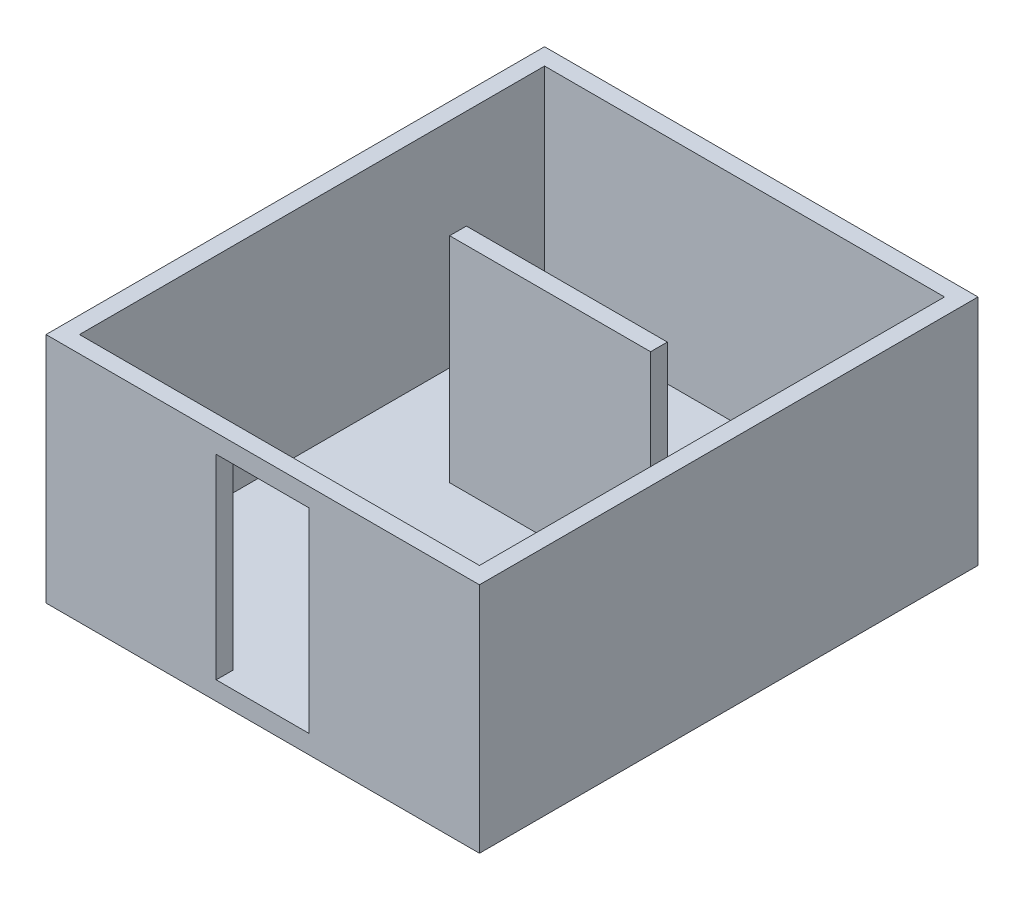
ISO-10303-21;
HEADER;
FILE_DESCRIPTION(('STEP AP214'),'2;1');
FILE_NAME('part.step','',(''),(''),'','','');
FILE_SCHEMA(('AUTOMOTIVE_DESIGN { 1 0 10303 214 1 1 1 1 }'));
ENDSEC;
DATA;
#1=APPLICATION_CONTEXT('core data for automotive mechanical design processes');
#2=APPLICATION_PROTOCOL_DEFINITION('international standard','automotive_design',2000,#1);
#3=PRODUCT_CONTEXT('',#1,'mechanical');
#4=PRODUCT('Part','Part','',(#3));
#5=PRODUCT_RELATED_PRODUCT_CATEGORY('part','',(#4));
#6=PRODUCT_DEFINITION_FORMATION('','',#4);
#7=PRODUCT_DEFINITION_CONTEXT('part definition',#1,'design');
#8=PRODUCT_DEFINITION('design','',#6,#7);
#9=PRODUCT_DEFINITION_SHAPE('','',#8);
#10=(LENGTH_UNIT() NAMED_UNIT(*) SI_UNIT(.MILLI.,.METRE.));
#11=(NAMED_UNIT(*) PLANE_ANGLE_UNIT() SI_UNIT($,.RADIAN.));
#12=(NAMED_UNIT(*) SI_UNIT($,.STERADIAN.) SOLID_ANGLE_UNIT());
#13=UNCERTAINTY_MEASURE_WITH_UNIT(LENGTH_MEASURE(1.E-05),#10,'distance_accuracy_value','');
#14=(GEOMETRIC_REPRESENTATION_CONTEXT(3) GLOBAL_UNCERTAINTY_ASSIGNED_CONTEXT((#13)) GLOBAL_UNIT_ASSIGNED_CONTEXT((#10,
#11,#12)) REPRESENTATION_CONTEXT('',''));
#15=CARTESIAN_POINT('',(0.,0.,0.));
#16=DIRECTION('',(0.,0.,1.));
#17=DIRECTION('',(1.,0.,0.));
#18=AXIS2_PLACEMENT_3D('',#15,#16,#17);
#19=CARTESIAN_POINT('',(0.,200.,0.));
#20=DIRECTION('',(1.,0.,0.));
#21=DIRECTION('',(0.,0.,-1.));
#22=AXIS2_PLACEMENT_3D('',#19,#20,#21);
#23=PLANE('',#22);
#24=DIRECTION('',(0.,0.,1.));
#25=VECTOR('',#24,1.);
#26=CARTESIAN_POINT('',(0.,0.,0.));
#27=LINE('',#26,#25);
#28=CARTESIAN_POINT('',(0.,0.,0.));
#29=VERTEX_POINT('',#28);
#30=CARTESIAN_POINT('',(6.56410684342981E-13,0.,5360.));
#31=VERTEX_POINT('',#30);
#32=EDGE_CURVE('E282',#29,#31,#27,.T.);
#33=ORIENTED_EDGE('',*,*,#32,.T.);
#34=DIRECTION('',(0.,-1.,0.));
#35=VECTOR('',#34,1.);
#36=CARTESIAN_POINT('',(6.56410684342981E-13,200.,5360.));
#37=LINE('',#36,#35);
#38=CARTESIAN_POINT('',(6.56410683868892E-13,2500.,5360.));
#39=VERTEX_POINT('',#38);
#40=EDGE_CURVE('E12',#39,#31,#37,.T.);
#41=ORIENTED_EDGE('',*,*,#40,.F.);
#42=DIRECTION('',(0.,0.,1.));
#43=VECTOR('',#42,1.);
#44=CARTESIAN_POINT('',(0.,2500.,0.));
#45=LINE('',#44,#43);
#46=CARTESIAN_POINT('',(0.,2500.,0.));
#47=VERTEX_POINT('',#46);
#48=EDGE_CURVE('E240',#47,#39,#45,.T.);
#49=ORIENTED_EDGE('',*,*,#48,.F.);
#50=DIRECTION('',(0.,-1.,0.));
#51=VECTOR('',#50,1.);
#52=CARTESIAN_POINT('',(0.,200.,0.));
#53=LINE('',#52,#51);
#54=EDGE_CURVE('E291',#47,#29,#53,.T.);
#55=ORIENTED_EDGE('',*,*,#54,.T.);
#56=EDGE_LOOP('',(#33,#41,#49,#55));
#57=FACE_BOUND('',#56,.T.);
#58=ADVANCED_FACE('F61',(#57),#23,.F.);
#59=CARTESIAN_POINT('',(6.56410684342981E-13,200.,5360.));
#60=DIRECTION('',(0.,0.,-1.));
#61=DIRECTION('',(-1.,0.,0.));
#62=AXIS2_PLACEMENT_3D('',#59,#60,#61);
#63=PLANE('',#62);
#64=DIRECTION('',(0.,-1.,0.));
#65=VECTOR('',#64,1.);
#66=CARTESIAN_POINT('',(1830.,2300.,5360.));
#67=LINE('',#66,#65);
#68=CARTESIAN_POINT('',(1830.,2300.,5360.));
#69=VERTEX_POINT('',#68);
#70=CARTESIAN_POINT('',(1830.,200.,5360.));
#71=VERTEX_POINT('',#70);
#72=EDGE_CURVE('E195',#69,#71,#67,.T.);
#73=ORIENTED_EDGE('',*,*,#72,.F.);
#74=DIRECTION('',(-1.,0.,0.));
#75=VECTOR('',#74,1.);
#76=CARTESIAN_POINT('',(1830.,2300.,5360.));
#77=LINE('',#76,#75);
#78=CARTESIAN_POINT('',(2830.,2300.,5360.));
#79=VERTEX_POINT('',#78);
#80=EDGE_CURVE('E187',#79,#69,#77,.T.);
#81=ORIENTED_EDGE('',*,*,#80,.F.);
#82=DIRECTION('',(0.,1.,0.));
#83=VECTOR('',#82,1.);
#84=CARTESIAN_POINT('',(2830.,2300.,5360.));
#85=LINE('',#84,#83);
#86=CARTESIAN_POINT('',(2830.,200.,5360.));
#87=VERTEX_POINT('',#86);
#88=EDGE_CURVE('E199',#87,#79,#85,.T.);
#89=ORIENTED_EDGE('',*,*,#88,.F.);
#90=DIRECTION('',(1.,0.,0.));
#91=VECTOR('',#90,1.);
#92=CARTESIAN_POINT('',(1830.,200.,5360.));
#93=LINE('',#92,#91);
#94=EDGE_CURVE('E75',#71,#87,#93,.T.);
#95=ORIENTED_EDGE('',*,*,#94,.F.);
#96=EDGE_LOOP('',(#73,#81,#89,#95));
#97=FACE_BOUND('',#96,.T.);
#98=DIRECTION('',(1.,0.,0.));
#99=VECTOR('',#98,1.);
#100=CARTESIAN_POINT('',(6.56410684342981E-13,0.,5360.));
#101=LINE('',#100,#99);
#102=CARTESIAN_POINT('',(4660.,0.,5360.));
#103=VERTEX_POINT('',#102);
#104=EDGE_CURVE('E285',#31,#103,#101,.T.);
#105=ORIENTED_EDGE('',*,*,#104,.T.);
#106=DIRECTION('',(0.,-1.,0.));
#107=VECTOR('',#106,1.);
#108=CARTESIAN_POINT('',(4660.,200.,5360.));
#109=LINE('',#108,#107);
#110=CARTESIAN_POINT('',(4660.,2500.,5360.));
#111=VERTEX_POINT('',#110);
#112=EDGE_CURVE('E68',#111,#103,#109,.T.);
#113=ORIENTED_EDGE('',*,*,#112,.F.);
#114=DIRECTION('',(1.,0.,0.));
#115=VECTOR('',#114,1.);
#116=CARTESIAN_POINT('',(0.,2500.,5360.));
#117=LINE('',#116,#115);
#118=EDGE_CURVE('E244',#39,#111,#117,.T.);
#119=ORIENTED_EDGE('',*,*,#118,.F.);
#120=ORIENTED_EDGE('',*,*,#40,.T.);
#121=EDGE_LOOP('',(#105,#113,#119,#120));
#122=FACE_BOUND('',#121,.T.);
#123=ADVANCED_FACE('F315',(#97,#122),#63,.F.);
#124=CARTESIAN_POINT('',(4660.,200.,0.));
#125=DIRECTION('',(-1.,0.,0.));
#126=DIRECTION('',(0.,0.,1.));
#127=AXIS2_PLACEMENT_3D('',#124,#125,#126);
#128=PLANE('',#127);
#129=DIRECTION('',(0.,0.,-1.));
#130=VECTOR('',#129,1.);
#131=CARTESIAN_POINT('',(4660.,0.,0.));
#132=LINE('',#131,#130);
#133=CARTESIAN_POINT('',(4660.,0.,0.));
#134=VERTEX_POINT('',#133);
#135=EDGE_CURVE('E287',#103,#134,#132,.T.);
#136=ORIENTED_EDGE('',*,*,#135,.T.);
#137=DIRECTION('',(0.,-1.,0.));
#138=VECTOR('',#137,1.);
#139=CARTESIAN_POINT('',(4660.,200.,0.));
#140=LINE('',#139,#138);
#141=CARTESIAN_POINT('',(4660.,2500.,0.));
#142=VERTEX_POINT('',#141);
#143=EDGE_CURVE('E294',#142,#134,#140,.T.);
#144=ORIENTED_EDGE('',*,*,#143,.F.);
#145=DIRECTION('',(0.,0.,-1.));
#146=VECTOR('',#145,1.);
#147=CARTESIAN_POINT('',(4660.,2500.,-7.72184969366154E-13));
#148=LINE('',#147,#146);
#149=EDGE_CURVE('E247',#111,#142,#148,.T.);
#150=ORIENTED_EDGE('',*,*,#149,.F.);
#151=ORIENTED_EDGE('',*,*,#112,.T.);
#152=EDGE_LOOP('',(#136,#144,#150,#151));
#153=FACE_BOUND('',#152,.T.);
#154=ADVANCED_FACE('F300',(#153),#128,.F.);
#155=CARTESIAN_POINT('',(0.,200.,0.));
#156=DIRECTION('',(0.,0.,1.));
#157=DIRECTION('',(1.,0.,0.));
#158=AXIS2_PLACEMENT_3D('',#155,#156,#157);
#159=PLANE('',#158);
#160=DIRECTION('',(-1.,0.,0.));
#161=VECTOR('',#160,1.);
#162=CARTESIAN_POINT('',(0.,0.,0.));
#163=LINE('',#162,#161);
#164=EDGE_CURVE('E289',#134,#29,#163,.T.);
#165=ORIENTED_EDGE('',*,*,#164,.T.);
#166=ORIENTED_EDGE('',*,*,#54,.F.);
#167=DIRECTION('',(-1.,0.,0.));
#168=VECTOR('',#167,1.);
#169=CARTESIAN_POINT('',(0.,2500.,0.));
#170=LINE('',#169,#168);
#171=EDGE_CURVE('E237',#142,#47,#170,.T.);
#172=ORIENTED_EDGE('',*,*,#171,.F.);
#173=ORIENTED_EDGE('',*,*,#143,.T.);
#174=EDGE_LOOP('',(#165,#166,#172,#173));
#175=FACE_BOUND('',#174,.T.);
#176=ADVANCED_FACE('F308',(#175),#159,.F.);
#177=CARTESIAN_POINT('',(0.,0.,0.));
#178=DIRECTION('',(0.,1.,0.));
#179=DIRECTION('',(0.,0.,1.));
#180=AXIS2_PLACEMENT_3D('',#177,#178,#179);
#181=PLANE('',#180);
#182=ORIENTED_EDGE('',*,*,#32,.F.);
#183=ORIENTED_EDGE('',*,*,#164,.F.);
#184=ORIENTED_EDGE('',*,*,#135,.F.);
#185=ORIENTED_EDGE('',*,*,#104,.F.);
#186=EDGE_LOOP('',(#182,#183,#184,#185));
#187=FACE_BOUND('',#186,.T.);
#188=ADVANCED_FACE('F306',(#187),#181,.F.);
#189=CARTESIAN_POINT('',(180.,2500.,0.));
#190=DIRECTION('',(1.,0.,0.));
#191=DIRECTION('',(0.,0.,-1.));
#192=AXIS2_PLACEMENT_3D('',#189,#190,#191);
#193=PLANE('',#192);
#194=DIRECTION('',(0.,0.,1.));
#195=VECTOR('',#194,1.);
#196=CARTESIAN_POINT('',(180.,200.,0.));
#197=LINE('',#196,#195);
#198=CARTESIAN_POINT('',(180.,200.,180.));
#199=VERTEX_POINT('',#198);
#200=CARTESIAN_POINT('',(180.000000000001,200.,5180.));
#201=VERTEX_POINT('',#200);
#202=EDGE_CURVE('E236',#199,#201,#197,.T.);
#203=ORIENTED_EDGE('',*,*,#202,.F.);
#204=DIRECTION('',(0.,-1.,0.));
#205=VECTOR('',#204,1.);
#206=CARTESIAN_POINT('',(180.,2500.,180.));
#207=LINE('',#206,#205);
#208=CARTESIAN_POINT('',(180.,2500.,180.));
#209=VERTEX_POINT('',#208);
#210=EDGE_CURVE('E279',#209,#199,#207,.T.);
#211=ORIENTED_EDGE('',*,*,#210,.F.);
#212=DIRECTION('',(0.,0.,1.));
#213=VECTOR('',#212,1.);
#214=CARTESIAN_POINT('',(180.,2500.,0.));
#215=LINE('',#214,#213);
#216=CARTESIAN_POINT('',(180.000000000001,2500.,5180.));
#217=VERTEX_POINT('',#216);
#218=EDGE_CURVE('E250',#209,#217,#215,.T.);
#219=ORIENTED_EDGE('',*,*,#218,.T.);
#220=DIRECTION('',(0.,-1.,0.));
#221=VECTOR('',#220,1.);
#222=CARTESIAN_POINT('',(180.000000000001,2500.,5180.));
#223=LINE('',#222,#221);
#224=EDGE_CURVE('E261',#217,#201,#223,.T.);
#225=ORIENTED_EDGE('',*,*,#224,.T.);
#226=EDGE_LOOP('',(#203,#211,#219,#225));
#227=FACE_BOUND('',#226,.T.);
#228=ADVANCED_FACE('F328',(#227),#193,.T.);
#229=CARTESIAN_POINT('',(0.,2500.,180.));
#230=DIRECTION('',(0.,0.,-1.));
#231=DIRECTION('',(-1.,0.,0.));
#232=AXIS2_PLACEMENT_3D('',#229,#230,#231);
#233=PLANE('',#232);
#234=DIRECTION('',(1.,0.,0.));
#235=VECTOR('',#234,1.);
#236=CARTESIAN_POINT('',(0.,200.,180.));
#237=LINE('',#236,#235);
#238=CARTESIAN_POINT('',(4480.,200.,180.));
#239=VERTEX_POINT('',#238);
#240=EDGE_CURVE('E263',#199,#239,#237,.T.);
#241=ORIENTED_EDGE('',*,*,#240,.T.);
#242=DIRECTION('',(0.,-1.,0.));
#243=VECTOR('',#242,1.);
#244=CARTESIAN_POINT('',(4480.,2500.,180.));
#245=LINE('',#244,#243);
#246=CARTESIAN_POINT('',(4480.,2500.,180.));
#247=VERTEX_POINT('',#246);
#248=EDGE_CURVE('E276',#247,#239,#245,.T.);
#249=ORIENTED_EDGE('',*,*,#248,.F.);
#250=DIRECTION('',(1.,0.,0.));
#251=VECTOR('',#250,1.);
#252=CARTESIAN_POINT('',(0.,2500.,180.));
#253=LINE('',#252,#251);
#254=EDGE_CURVE('E253',#209,#247,#253,.T.);
#255=ORIENTED_EDGE('',*,*,#254,.F.);
#256=ORIENTED_EDGE('',*,*,#210,.T.);
#257=EDGE_LOOP('',(#241,#249,#255,#256));
#258=FACE_BOUND('',#257,.T.);
#259=ADVANCED_FACE('F336',(#258),#233,.F.);
#260=CARTESIAN_POINT('',(4480.,2500.,-7.95807864051312E-13));
#261=DIRECTION('',(1.,0.,0.));
#262=DIRECTION('',(0.,0.,-1.));
#263=AXIS2_PLACEMENT_3D('',#260,#261,#262);
#264=PLANE('',#263);
#265=DIRECTION('',(0.,0.,1.));
#266=VECTOR('',#265,1.);
#267=CARTESIAN_POINT('',(4480.,200.,-7.95807864051312E-13));
#268=LINE('',#267,#266);
#269=CARTESIAN_POINT('',(4480.,200.,5180.));
#270=VERTEX_POINT('',#269);
#271=EDGE_CURVE('E266',#239,#270,#268,.T.);
#272=ORIENTED_EDGE('',*,*,#271,.T.);
#273=DIRECTION('',(0.,-1.,0.));
#274=VECTOR('',#273,1.);
#275=CARTESIAN_POINT('',(4480.,2500.,5180.));
#276=LINE('',#275,#274);
#277=CARTESIAN_POINT('',(4480.,2500.,5180.));
#278=VERTEX_POINT('',#277);
#279=EDGE_CURVE('E273',#278,#270,#276,.T.);
#280=ORIENTED_EDGE('',*,*,#279,.F.);
#281=DIRECTION('',(0.,0.,1.));
#282=VECTOR('',#281,1.);
#283=CARTESIAN_POINT('',(4480.,2500.,-7.95807864051312E-13));
#284=LINE('',#283,#282);
#285=EDGE_CURVE('E256',#247,#278,#284,.T.);
#286=ORIENTED_EDGE('',*,*,#285,.F.);
#287=ORIENTED_EDGE('',*,*,#248,.T.);
#288=EDGE_LOOP('',(#272,#280,#286,#287));
#289=FACE_BOUND('',#288,.T.);
#290=ADVANCED_FACE('F340',(#289),#264,.F.);
#291=CARTESIAN_POINT('',(0.,2500.,5180.));
#292=DIRECTION('',(0.,0.,-1.));
#293=DIRECTION('',(-1.,0.,0.));
#294=AXIS2_PLACEMENT_3D('',#291,#292,#293);
#295=PLANE('',#294);
#296=DIRECTION('',(0.,-1.,0.));
#297=VECTOR('',#296,1.);
#298=CARTESIAN_POINT('',(1830.,2300.,5180.));
#299=LINE('',#298,#297);
#300=CARTESIAN_POINT('',(1830.,2300.,5180.));
#301=VERTEX_POINT('',#300);
#302=CARTESIAN_POINT('',(1830.,200.,5180.));
#303=VERTEX_POINT('',#302);
#304=EDGE_CURVE('E170',#301,#303,#299,.T.);
#305=ORIENTED_EDGE('',*,*,#304,.T.);
#306=DIRECTION('',(1.,0.,0.));
#307=VECTOR('',#306,1.);
#308=CARTESIAN_POINT('',(0.,200.,5180.));
#309=LINE('',#308,#307);
#310=EDGE_CURVE('E241',#201,#303,#309,.T.);
#311=ORIENTED_EDGE('',*,*,#310,.F.);
#312=ORIENTED_EDGE('',*,*,#224,.F.);
#313=DIRECTION('',(1.,0.,0.));
#314=VECTOR('',#313,1.);
#315=CARTESIAN_POINT('',(0.,2500.,5180.));
#316=LINE('',#315,#314);
#317=EDGE_CURVE('E258',#217,#278,#316,.T.);
#318=ORIENTED_EDGE('',*,*,#317,.T.);
#319=ORIENTED_EDGE('',*,*,#279,.T.);
#320=CARTESIAN_POINT('',(2830.,200.,5180.));
#321=VERTEX_POINT('',#320);
#322=EDGE_CURVE('E269',#321,#270,#309,.T.);
#323=ORIENTED_EDGE('',*,*,#322,.F.);
#324=DIRECTION('',(0.,1.,0.));
#325=VECTOR('',#324,1.);
#326=CARTESIAN_POINT('',(2830.,2300.,5180.));
#327=LINE('',#326,#325);
#328=CARTESIAN_POINT('',(2830.,2300.,5180.));
#329=VERTEX_POINT('',#328);
#330=EDGE_CURVE('E193',#321,#329,#327,.T.);
#331=ORIENTED_EDGE('',*,*,#330,.T.);
#332=DIRECTION('',(-1.,0.,0.));
#333=VECTOR('',#332,1.);
#334=CARTESIAN_POINT('',(1830.,2300.,5180.));
#335=LINE('',#334,#333);
#336=EDGE_CURVE('E184',#329,#301,#335,.T.);
#337=ORIENTED_EDGE('',*,*,#336,.T.);
#338=EDGE_LOOP('',(#305,#311,#312,#318,#319,#323,#331,#337));
#339=FACE_BOUND('',#338,.T.);
#340=ADVANCED_FACE('F191',(#339),#295,.T.);
#341=CARTESIAN_POINT('',(0.,2500.,0.));
#342=DIRECTION('',(0.,1.,0.));
#343=DIRECTION('',(0.,0.,1.));
#344=AXIS2_PLACEMENT_3D('',#341,#342,#343);
#345=PLANE('',#344);
#346=ORIENTED_EDGE('',*,*,#171,.T.);
#347=ORIENTED_EDGE('',*,*,#48,.T.);
#348=ORIENTED_EDGE('',*,*,#118,.T.);
#349=ORIENTED_EDGE('',*,*,#149,.T.);
#350=EDGE_LOOP('',(#346,#347,#348,#349));
#351=FACE_BOUND('',#350,.T.);
#352=ORIENTED_EDGE('',*,*,#218,.F.);
#353=ORIENTED_EDGE('',*,*,#254,.T.);
#354=ORIENTED_EDGE('',*,*,#285,.T.);
#355=ORIENTED_EDGE('',*,*,#317,.F.);
#356=EDGE_LOOP('',(#352,#353,#354,#355));
#357=FACE_BOUND('',#356,.T.);
#358=ADVANCED_FACE('F313',(#351,#357),#345,.T.);
#359=CARTESIAN_POINT('',(0.,200.,0.));
#360=DIRECTION('',(0.,1.,0.));
#361=DIRECTION('',(0.,0.,1.));
#362=AXIS2_PLACEMENT_3D('',#359,#360,#361);
#363=PLANE('',#362);
#364=DIRECTION('',(0.,0.,-1.));
#365=VECTOR('',#364,1.);
#366=CARTESIAN_POINT('',(1250.,200.,0.));
#367=LINE('',#366,#365);
#368=CARTESIAN_POINT('',(1250.,200.,2270.));
#369=VERTEX_POINT('',#368);
#370=CARTESIAN_POINT('',(1250.,200.,2090.));
#371=VERTEX_POINT('',#370);
#372=EDGE_CURVE('E206',#369,#371,#367,.T.);
#373=ORIENTED_EDGE('',*,*,#372,.T.);
#374=DIRECTION('',(-1.,0.,0.));
#375=VECTOR('',#374,1.);
#376=CARTESIAN_POINT('',(4.29697429901218E-13,200.,2090.));
#377=LINE('',#376,#375);
#378=CARTESIAN_POINT('',(3410.,200.,2090.));
#379=VERTEX_POINT('',#378);
#380=EDGE_CURVE('E211',#379,#371,#377,.T.);
#381=ORIENTED_EDGE('',*,*,#380,.F.);
#382=DIRECTION('',(0.,0.,-1.));
#383=VECTOR('',#382,1.);
#384=CARTESIAN_POINT('',(3410.,200.,0.));
#385=LINE('',#384,#383);
#386=CARTESIAN_POINT('',(3410.,200.,2270.));
#387=VERTEX_POINT('',#386);
#388=EDGE_CURVE('E224',#387,#379,#385,.T.);
#389=ORIENTED_EDGE('',*,*,#388,.F.);
#390=DIRECTION('',(-1.,0.,0.));
#391=VECTOR('',#390,1.);
#392=CARTESIAN_POINT('',(4.6670486405539E-13,200.,2270.));
#393=LINE('',#392,#391);
#394=EDGE_CURVE('E221',#387,#369,#393,.T.);
#395=ORIENTED_EDGE('',*,*,#394,.T.);
#396=EDGE_LOOP('',(#373,#381,#389,#395));
#397=FACE_BOUND('',#396,.T.);
#398=ORIENTED_EDGE('',*,*,#202,.T.);
#399=ORIENTED_EDGE('',*,*,#310,.T.);
#400=DIRECTION('',(0.,0.,1.));
#401=VECTOR('',#400,1.);
#402=CARTESIAN_POINT('',(1830.,200.,2854.0593300774));
#403=LINE('',#402,#401);
#404=EDGE_CURVE('E176',#303,#71,#403,.T.);
#405=ORIENTED_EDGE('',*,*,#404,.T.);
#406=ORIENTED_EDGE('',*,*,#94,.T.);
#407=DIRECTION('',(0.,0.,1.));
#408=VECTOR('',#407,1.);
#409=CARTESIAN_POINT('',(2830.,200.,2854.0593300774));
#410=LINE('',#409,#408);
#411=EDGE_CURVE('E79',#321,#87,#410,.T.);
#412=ORIENTED_EDGE('',*,*,#411,.F.);
#413=ORIENTED_EDGE('',*,*,#322,.T.);
#414=ORIENTED_EDGE('',*,*,#271,.F.);
#415=ORIENTED_EDGE('',*,*,#240,.F.);
#416=EDGE_LOOP('',(#398,#399,#405,#406,#412,#413,#414,#415));
#417=FACE_BOUND('',#416,.T.);
#418=ADVANCED_FACE('F329',(#397,#417),#363,.T.);
#419=CARTESIAN_POINT('',(1250.,2500.,0.));
#420=DIRECTION('',(-1.,0.,0.));
#421=DIRECTION('',(0.,0.,1.));
#422=AXIS2_PLACEMENT_3D('',#419,#420,#421);
#423=PLANE('',#422);
#424=ORIENTED_EDGE('',*,*,#372,.F.);
#425=DIRECTION('',(0.,-1.,0.));
#426=VECTOR('',#425,1.);
#427=CARTESIAN_POINT('',(1250.,2500.,2270.));
#428=LINE('',#427,#426);
#429=CARTESIAN_POINT('',(1250.,2500.,2270.));
#430=VERTEX_POINT('',#429);
#431=EDGE_CURVE('E234',#430,#369,#428,.T.);
#432=ORIENTED_EDGE('',*,*,#431,.F.);
#433=DIRECTION('',(0.,0.,-1.));
#434=VECTOR('',#433,1.);
#435=CARTESIAN_POINT('',(1250.,2500.,0.));
#436=LINE('',#435,#434);
#437=CARTESIAN_POINT('',(1250.,2500.,2090.));
#438=VERTEX_POINT('',#437);
#439=EDGE_CURVE('E207',#430,#438,#436,.T.);
#440=ORIENTED_EDGE('',*,*,#439,.T.);
#441=DIRECTION('',(0.,-1.,0.));
#442=VECTOR('',#441,1.);
#443=CARTESIAN_POINT('',(1250.,2500.,2090.));
#444=LINE('',#443,#442);
#445=EDGE_CURVE('E218',#438,#371,#444,.T.);
#446=ORIENTED_EDGE('',*,*,#445,.T.);
#447=EDGE_LOOP('',(#424,#432,#440,#446));
#448=FACE_BOUND('',#447,.T.);
#449=ADVANCED_FACE('F332',(#448),#423,.T.);
#450=CARTESIAN_POINT('',(4.6670486405539E-13,2500.,2270.));
#451=DIRECTION('',(0.,0.,1.));
#452=DIRECTION('',(1.,0.,0.));
#453=AXIS2_PLACEMENT_3D('',#450,#451,#452);
#454=PLANE('',#453);
#455=ORIENTED_EDGE('',*,*,#394,.F.);
#456=DIRECTION('',(0.,-1.,0.));
#457=VECTOR('',#456,1.);
#458=CARTESIAN_POINT('',(3410.,2500.,2270.));
#459=LINE('',#458,#457);
#460=CARTESIAN_POINT('',(3410.,2500.,2270.));
#461=VERTEX_POINT('',#460);
#462=EDGE_CURVE('E232',#461,#387,#459,.T.);
#463=ORIENTED_EDGE('',*,*,#462,.F.);
#464=DIRECTION('',(-1.,0.,0.));
#465=VECTOR('',#464,1.);
#466=CARTESIAN_POINT('',(4.6670486405539E-13,2500.,2270.));
#467=LINE('',#466,#465);
#468=EDGE_CURVE('E210',#461,#430,#467,.T.);
#469=ORIENTED_EDGE('',*,*,#468,.T.);
#470=ORIENTED_EDGE('',*,*,#431,.T.);
#471=EDGE_LOOP('',(#455,#463,#469,#470));
#472=FACE_BOUND('',#471,.T.);
#473=ADVANCED_FACE('F351',(#472),#454,.T.);
#474=CARTESIAN_POINT('',(3410.,2500.,0.));
#475=DIRECTION('',(-1.,0.,0.));
#476=DIRECTION('',(0.,0.,1.));
#477=AXIS2_PLACEMENT_3D('',#474,#475,#476);
#478=PLANE('',#477);
#479=ORIENTED_EDGE('',*,*,#388,.T.);
#480=DIRECTION('',(0.,-1.,0.));
#481=VECTOR('',#480,1.);
#482=CARTESIAN_POINT('',(3410.,2500.,2090.));
#483=LINE('',#482,#481);
#484=CARTESIAN_POINT('',(3410.,2500.,2090.));
#485=VERTEX_POINT('',#484);
#486=EDGE_CURVE('E230',#485,#379,#483,.T.);
#487=ORIENTED_EDGE('',*,*,#486,.F.);
#488=DIRECTION('',(0.,0.,-1.));
#489=VECTOR('',#488,1.);
#490=CARTESIAN_POINT('',(3410.,2500.,0.));
#491=LINE('',#490,#489);
#492=EDGE_CURVE('E214',#461,#485,#491,.T.);
#493=ORIENTED_EDGE('',*,*,#492,.F.);
#494=ORIENTED_EDGE('',*,*,#462,.T.);
#495=EDGE_LOOP('',(#479,#487,#493,#494));
#496=FACE_BOUND('',#495,.T.);
#497=ADVANCED_FACE('F355',(#496),#478,.F.);
#498=CARTESIAN_POINT('',(4.29697429901218E-13,2500.,2090.));
#499=DIRECTION('',(0.,0.,1.));
#500=DIRECTION('',(1.,0.,0.));
#501=AXIS2_PLACEMENT_3D('',#498,#499,#500);
#502=PLANE('',#501);
#503=ORIENTED_EDGE('',*,*,#380,.T.);
#504=ORIENTED_EDGE('',*,*,#445,.F.);
#505=DIRECTION('',(-1.,0.,0.));
#506=VECTOR('',#505,1.);
#507=CARTESIAN_POINT('',(4.29697429901218E-13,2500.,2090.));
#508=LINE('',#507,#506);
#509=EDGE_CURVE('E216',#485,#438,#508,.T.);
#510=ORIENTED_EDGE('',*,*,#509,.F.);
#511=ORIENTED_EDGE('',*,*,#486,.T.);
#512=EDGE_LOOP('',(#503,#504,#510,#511));
#513=FACE_BOUND('',#512,.T.);
#514=ADVANCED_FACE('F359',(#513),#502,.F.);
#515=CARTESIAN_POINT('',(0.,2500.,0.));
#516=DIRECTION('',(0.,1.,0.));
#517=DIRECTION('',(0.,0.,1.));
#518=AXIS2_PLACEMENT_3D('',#515,#516,#517);
#519=PLANE('',#518);
#520=ORIENTED_EDGE('',*,*,#439,.F.);
#521=ORIENTED_EDGE('',*,*,#468,.F.);
#522=ORIENTED_EDGE('',*,*,#492,.T.);
#523=ORIENTED_EDGE('',*,*,#509,.T.);
#524=EDGE_LOOP('',(#520,#521,#522,#523));
#525=FACE_BOUND('',#524,.T.);
#526=ADVANCED_FACE('F363',(#525),#519,.T.);
#527=CARTESIAN_POINT('',(1830.,2300.,2854.0593300774));
#528=DIRECTION('',(0.,1.,0.));
#529=DIRECTION('',(0.,0.,1.));
#530=AXIS2_PLACEMENT_3D('',#527,#528,#529);
#531=PLANE('',#530);
#532=DIRECTION('',(0.,0.,1.));
#533=VECTOR('',#532,1.);
#534=CARTESIAN_POINT('',(2830.,2300.,2854.0593300774));
#535=LINE('',#534,#533);
#536=EDGE_CURVE('E201',#329,#79,#535,.T.);
#537=ORIENTED_EDGE('',*,*,#536,.T.);
#538=ORIENTED_EDGE('',*,*,#80,.T.);
#539=DIRECTION('',(0.,0.,1.));
#540=VECTOR('',#539,1.);
#541=CARTESIAN_POINT('',(1830.,2300.,2854.0593300774));
#542=LINE('',#541,#540);
#543=EDGE_CURVE('E174',#301,#69,#542,.T.);
#544=ORIENTED_EDGE('',*,*,#543,.F.);
#545=ORIENTED_EDGE('',*,*,#336,.F.);
#546=EDGE_LOOP('',(#537,#538,#544,#545));
#547=FACE_BOUND('',#546,.T.);
#548=ADVANCED_FACE('F183',(#547),#531,.F.);
#549=CARTESIAN_POINT('',(1830.,2300.,2854.0593300774));
#550=DIRECTION('',(-1.,0.,0.));
#551=DIRECTION('',(0.,-1.,0.));
#552=AXIS2_PLACEMENT_3D('',#549,#550,#551);
#553=PLANE('',#552);
#554=ORIENTED_EDGE('',*,*,#543,.T.);
#555=ORIENTED_EDGE('',*,*,#72,.T.);
#556=ORIENTED_EDGE('',*,*,#404,.F.);
#557=ORIENTED_EDGE('',*,*,#304,.F.);
#558=EDGE_LOOP('',(#554,#555,#556,#557));
#559=FACE_BOUND('',#558,.T.);
#560=ADVANCED_FACE('F172',(#559),#553,.F.);
#561=CARTESIAN_POINT('',(2830.,2300.,2854.0593300774));
#562=DIRECTION('',(1.,0.,0.));
#563=DIRECTION('',(0.,0.,-1.));
#564=AXIS2_PLACEMENT_3D('',#561,#562,#563);
#565=PLANE('',#564);
#566=ORIENTED_EDGE('',*,*,#411,.T.);
#567=ORIENTED_EDGE('',*,*,#88,.T.);
#568=ORIENTED_EDGE('',*,*,#536,.F.);
#569=ORIENTED_EDGE('',*,*,#330,.F.);
#570=EDGE_LOOP('',(#566,#567,#568,#569));
#571=FACE_BOUND('',#570,.T.);
#572=ADVANCED_FACE('F372',(#571),#565,.F.);
#573=CLOSED_SHELL('',(#58,#123,#154,#176,#188,#228,#259,#290,#340,#358,#418,#449,#473,#497,#514,
#526,#548,#560,#572));
#574=MANIFOLD_SOLID_BREP('B2',#573);
#575=ADVANCED_BREP_SHAPE_REPRESENTATION('',(#18,#574),#14);
#576=SHAPE_DEFINITION_REPRESENTATION(#9,#575);
ENDSEC;
END-ISO-10303-21;
